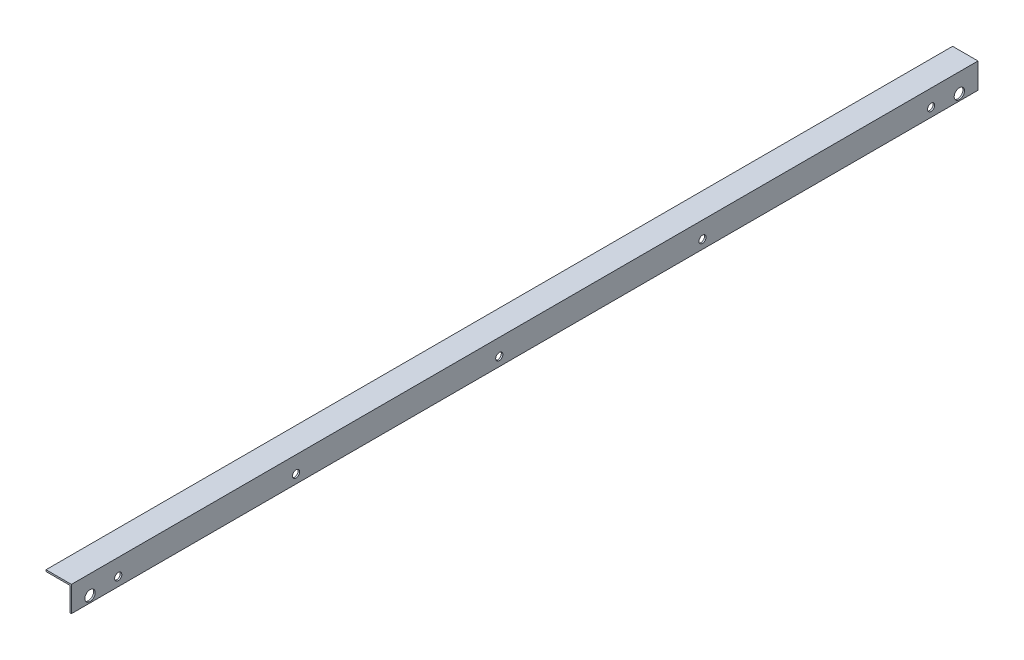
ISO-10303-21;
HEADER;
FILE_DESCRIPTION(('STEP AP214'),'2;1');
FILE_NAME('part.step','',(''),(''),'','','');
FILE_SCHEMA(('AUTOMOTIVE_DESIGN { 1 0 10303 214 1 1 1 1 }'));
ENDSEC;
DATA;
#1=APPLICATION_CONTEXT('core data for automotive mechanical design processes');
#2=APPLICATION_PROTOCOL_DEFINITION('international standard','automotive_design',2000,#1);
#3=PRODUCT_CONTEXT('',#1,'mechanical');
#4=PRODUCT('Part','Part','',(#3));
#5=PRODUCT_RELATED_PRODUCT_CATEGORY('part','',(#4));
#6=PRODUCT_DEFINITION_FORMATION('','',#4);
#7=PRODUCT_DEFINITION_CONTEXT('part definition',#1,'design');
#8=PRODUCT_DEFINITION('design','',#6,#7);
#9=PRODUCT_DEFINITION_SHAPE('','',#8);
#10=(LENGTH_UNIT() NAMED_UNIT(*) SI_UNIT(.MILLI.,.METRE.));
#11=(NAMED_UNIT(*) PLANE_ANGLE_UNIT() SI_UNIT($,.RADIAN.));
#12=(NAMED_UNIT(*) SI_UNIT($,.STERADIAN.) SOLID_ANGLE_UNIT());
#13=UNCERTAINTY_MEASURE_WITH_UNIT(LENGTH_MEASURE(1.E-05),#10,'distance_accuracy_value','');
#14=(GEOMETRIC_REPRESENTATION_CONTEXT(3) GLOBAL_UNCERTAINTY_ASSIGNED_CONTEXT((#13)) GLOBAL_UNIT_ASSIGNED_CONTEXT((#10,
#11,#12)) REPRESENTATION_CONTEXT('',''));
#15=CARTESIAN_POINT('',(0.,0.,0.));
#16=DIRECTION('',(0.,0.,1.));
#17=DIRECTION('',(1.,0.,0.));
#18=AXIS2_PLACEMENT_3D('',#15,#16,#17);
#19=CARTESIAN_POINT('',(26.4682271036927,-4.73976383644786,0.));
#20=DIRECTION('',(-1.,0.,0.));
#21=DIRECTION('',(0.,0.,1.));
#22=AXIS2_PLACEMENT_3D('',#19,#20,#21);
#23=PLANE('',#22);
#24=CARTESIAN_POINT('',(26.4682271036927,7.96023616355214,37.3062499999997));
#25=DIRECTION('',(1.,0.,0.));
#26=DIRECTION('',(0.,1.,0.));
#27=AXIS2_PLACEMENT_3D('',#24,#25,#26);
#28=CIRCLE('',#27,10.31875);
#29=CARTESIAN_POINT('',(26.4682271036927,18.2789861635521,37.3062499999997));
#30=VERTEX_POINT('',#29);
#31=EDGE_CURVE('E85',#30,#30,#28,.T.);
#32=ORIENTED_EDGE('',*,*,#31,.T.);
#33=EDGE_LOOP('',(#32));
#34=FACE_BOUND('',#33,.T.);
#35=CARTESIAN_POINT('',(26.4682271036927,7.96023616355214,1775.61875));
#36=DIRECTION('',(1.,0.,0.));
#37=DIRECTION('',(0.,1.,0.));
#38=AXIS2_PLACEMENT_3D('',#35,#36,#37);
#39=CIRCLE('',#38,10.31875);
#40=CARTESIAN_POINT('',(26.4682271036927,18.2789861635521,1775.61875));
#41=VERTEX_POINT('',#40);
#42=EDGE_CURVE('E122',#41,#41,#39,.T.);
#43=ORIENTED_EDGE('',*,*,#42,.T.);
#44=EDGE_LOOP('',(#43));
#45=FACE_BOUND('',#44,.T.);
#46=CARTESIAN_POINT('',(26.4682271036927,12.7227361635521,1719.2625));
#47=DIRECTION('',(1.,0.,0.));
#48=DIRECTION('',(0.,1.,0.));
#49=AXIS2_PLACEMENT_3D('',#46,#47,#48);
#50=CIRCLE('',#49,7.14375);
#51=CARTESIAN_POINT('',(26.4682271036927,19.8664861635521,1719.2625));
#52=VERTEX_POINT('',#51);
#53=EDGE_CURVE('E125',#52,#52,#50,.T.);
#54=ORIENTED_EDGE('',*,*,#53,.T.);
#55=EDGE_LOOP('',(#54));
#56=FACE_BOUND('',#55,.T.);
#57=CARTESIAN_POINT('',(26.4682271036927,12.7227361635521,1363.6625));
#58=DIRECTION('',(1.,0.,0.));
#59=DIRECTION('',(0.,1.,0.));
#60=AXIS2_PLACEMENT_3D('',#57,#58,#59);
#61=CIRCLE('',#60,7.14375);
#62=CARTESIAN_POINT('',(26.4682271036927,19.8664861635521,1363.6625));
#63=VERTEX_POINT('',#62);
#64=EDGE_CURVE('E128',#63,#63,#61,.T.);
#65=ORIENTED_EDGE('',*,*,#64,.T.);
#66=EDGE_LOOP('',(#65));
#67=FACE_BOUND('',#66,.T.);
#68=CARTESIAN_POINT('',(26.4682271036927,12.7227361635521,957.2625));
#69=DIRECTION('',(1.,0.,0.));
#70=DIRECTION('',(0.,1.,0.));
#71=AXIS2_PLACEMENT_3D('',#68,#69,#70);
#72=CIRCLE('',#71,7.14375);
#73=CARTESIAN_POINT('',(26.4682271036927,19.8664861635521,957.2625));
#74=VERTEX_POINT('',#73);
#75=EDGE_CURVE('E131',#74,#74,#72,.T.);
#76=ORIENTED_EDGE('',*,*,#75,.T.);
#77=EDGE_LOOP('',(#76));
#78=FACE_BOUND('',#77,.T.);
#79=CARTESIAN_POINT('',(26.4682271036927,12.7227361635521,550.8625));
#80=DIRECTION('',(1.,0.,0.));
#81=DIRECTION('',(0.,1.,0.));
#82=AXIS2_PLACEMENT_3D('',#79,#80,#81);
#83=CIRCLE('',#82,7.14375);
#84=CARTESIAN_POINT('',(26.4682271036927,19.8664861635521,550.8625));
#85=VERTEX_POINT('',#84);
#86=EDGE_CURVE('E133',#85,#85,#83,.T.);
#87=ORIENTED_EDGE('',*,*,#86,.T.);
#88=EDGE_LOOP('',(#87));
#89=FACE_BOUND('',#88,.T.);
#90=CARTESIAN_POINT('',(26.4682271036927,12.7227361635521,93.6625));
#91=DIRECTION('',(1.,0.,0.));
#92=DIRECTION('',(0.,1.,0.));
#93=AXIS2_PLACEMENT_3D('',#90,#91,#92);
#94=CIRCLE('',#93,7.14375);
#95=CARTESIAN_POINT('',(26.4682271036927,19.8664861635521,93.6625));
#96=VERTEX_POINT('',#95);
#97=EDGE_CURVE('E20',#96,#96,#94,.T.);
#98=ORIENTED_EDGE('',*,*,#97,.T.);
#99=EDGE_LOOP('',(#98));
#100=FACE_BOUND('',#99,.T.);
#101=DIRECTION('',(0.,1.,0.));
#102=VECTOR('',#101,1.);
#103=CARTESIAN_POINT('',(26.4682271036927,31.8223455385522,1812.925));
#104=LINE('',#103,#102);
#105=CARTESIAN_POINT('',(26.4682271036927,42.8852361635522,1812.925));
#106=VERTEX_POINT('',#105);
#107=CARTESIAN_POINT('',(26.4682271036927,-4.73976383644786,1812.925));
#108=VERTEX_POINT('',#107);
#109=EDGE_CURVE('E73',#106,#108,#104,.F.);
#110=ORIENTED_EDGE('',*,*,#109,.F.);
#111=DIRECTION('',(0.,0.,-1.));
#112=VECTOR('',#111,1.);
#113=CARTESIAN_POINT('',(26.4682271036927,42.8852361635522,0.));
#114=LINE('',#113,#112);
#115=CARTESIAN_POINT('',(26.4682271036927,42.8852361635522,0.));
#116=VERTEX_POINT('',#115);
#117=EDGE_CURVE('E70',#116,#106,#114,.F.);
#118=ORIENTED_EDGE('',*,*,#117,.F.);
#119=DIRECTION('',(0.,1.,0.));
#120=VECTOR('',#119,1.);
#121=CARTESIAN_POINT('',(26.4682271036927,31.8223455385522,0.));
#122=LINE('',#121,#120);
#123=CARTESIAN_POINT('',(26.4682271036927,-4.73976383644786,0.));
#124=VERTEX_POINT('',#123);
#125=EDGE_CURVE('E67',#116,#124,#122,.F.);
#126=ORIENTED_EDGE('',*,*,#125,.T.);
#127=DIRECTION('',(0.,0.,-1.));
#128=VECTOR('',#127,1.);
#129=CARTESIAN_POINT('',(26.4682271036927,-4.73976383644786,0.));
#130=LINE('',#129,#128);
#131=EDGE_CURVE('E77',#108,#124,#130,.T.);
#132=ORIENTED_EDGE('',*,*,#131,.F.);
#133=EDGE_LOOP('',(#110,#118,#126,#132));
#134=FACE_BOUND('',#133,.T.);
#135=ADVANCED_FACE('F17',(#34,#45,#56,#67,#78,#89,#100,#134),#23,.T.);
#136=CARTESIAN_POINT('',(26.4682271036927,42.8852361635522,0.));
#137=DIRECTION('',(0.,-1.,0.));
#138=DIRECTION('',(0.,0.,-1.));
#139=AXIS2_PLACEMENT_3D('',#136,#137,#138);
#140=PLANE('',#139);
#141=DIRECTION('',(1.,0.,0.));
#142=VECTOR('',#141,1.);
#143=CARTESIAN_POINT('',(15.4053364786927,42.8852361635522,1812.925));
#144=LINE('',#143,#142);
#145=CARTESIAN_POINT('',(-21.1567728963072,42.8852361635522,1812.925));
#146=VERTEX_POINT('',#145);
#147=EDGE_CURVE('E319',#146,#106,#144,.T.);
#148=ORIENTED_EDGE('',*,*,#147,.F.);
#149=DIRECTION('',(0.,0.,1.));
#150=VECTOR('',#149,1.);
#151=CARTESIAN_POINT('',(-21.1567728963072,42.8852361635522,0.));
#152=LINE('',#151,#150);
#153=CARTESIAN_POINT('',(-21.1567728963072,42.8852361635522,0.));
#154=VERTEX_POINT('',#153);
#155=EDGE_CURVE('E82',#154,#146,#152,.T.);
#156=ORIENTED_EDGE('',*,*,#155,.F.);
#157=DIRECTION('',(1.,0.,0.));
#158=VECTOR('',#157,1.);
#159=CARTESIAN_POINT('',(15.4053364786927,42.8852361635522,0.));
#160=LINE('',#159,#158);
#161=EDGE_CURVE('E80',#154,#116,#160,.T.);
#162=ORIENTED_EDGE('',*,*,#161,.T.);
#163=ORIENTED_EDGE('',*,*,#117,.T.);
#164=EDGE_LOOP('',(#148,#156,#162,#163));
#165=FACE_BOUND('',#164,.T.);
#166=ADVANCED_FACE('F81',(#165),#140,.T.);
#167=CARTESIAN_POINT('',(29.6432271036926,-4.73976383644786,0.));
#168=DIRECTION('',(0.,-1.,0.));
#169=DIRECTION('',(0.,0.,-1.));
#170=AXIS2_PLACEMENT_3D('',#167,#168,#169);
#171=PLANE('',#170);
#172=DIRECTION('',(1.,0.,0.));
#173=VECTOR('',#172,1.);
#174=CARTESIAN_POINT('',(15.4053364786927,-4.73976383644786,1812.925));
#175=LINE('',#174,#173);
#176=CARTESIAN_POINT('',(29.6432271036926,-4.73976383644786,1812.925));
#177=VERTEX_POINT('',#176);
#178=EDGE_CURVE('E327',#108,#177,#175,.T.);
#179=ORIENTED_EDGE('',*,*,#178,.F.);
#180=ORIENTED_EDGE('',*,*,#131,.T.);
#181=DIRECTION('',(1.,0.,0.));
#182=VECTOR('',#181,1.);
#183=CARTESIAN_POINT('',(15.4053364786927,-4.73976383644786,0.));
#184=LINE('',#183,#182);
#185=CARTESIAN_POINT('',(29.6432271036926,-4.73976383644786,0.));
#186=VERTEX_POINT('',#185);
#187=EDGE_CURVE('E90',#124,#186,#184,.T.);
#188=ORIENTED_EDGE('',*,*,#187,.T.);
#189=DIRECTION('',(0.,0.,-1.));
#190=VECTOR('',#189,1.);
#191=CARTESIAN_POINT('',(29.6432271036926,-4.73976383644785,0.));
#192=LINE('',#191,#190);
#193=EDGE_CURVE('E119',#177,#186,#192,.T.);
#194=ORIENTED_EDGE('',*,*,#193,.F.);
#195=EDGE_LOOP('',(#179,#180,#188,#194));
#196=FACE_BOUND('',#195,.T.);
#197=ADVANCED_FACE('F144',(#196),#171,.T.);
#198=CARTESIAN_POINT('',(26.4682271036927,12.7227361635521,93.6625));
#199=DIRECTION('',(1.,0.,0.));
#200=DIRECTION('',(0.,1.,0.));
#201=AXIS2_PLACEMENT_3D('',#198,#199,#200);
#202=CYLINDRICAL_SURFACE('',#201,7.14375);
#203=CARTESIAN_POINT('',(29.6432271036926,12.7227361635521,93.6625));
#204=DIRECTION('',(1.,0.,0.));
#205=DIRECTION('',(0.,1.,0.));
#206=AXIS2_PLACEMENT_3D('',#203,#204,#205);
#207=CIRCLE('',#206,7.14375);
#208=CARTESIAN_POINT('',(29.6432271036926,19.8664861635521,93.6625));
#209=VERTEX_POINT('',#208);
#210=EDGE_CURVE('E116',#209,#209,#207,.F.);
#211=ORIENTED_EDGE('',*,*,#210,.F.);
#212=EDGE_LOOP('',(#211));
#213=FACE_BOUND('',#212,.T.);
#214=ORIENTED_EDGE('',*,*,#97,.F.);
#215=EDGE_LOOP('',(#214));
#216=FACE_BOUND('',#215,.T.);
#217=ADVANCED_FACE('F141',(#213,#216),#202,.F.);
#218=CARTESIAN_POINT('',(26.4682271036927,12.7227361635521,550.8625));
#219=DIRECTION('',(1.,0.,0.));
#220=DIRECTION('',(0.,1.,0.));
#221=AXIS2_PLACEMENT_3D('',#218,#219,#220);
#222=CYLINDRICAL_SURFACE('',#221,7.14375);
#223=CARTESIAN_POINT('',(29.6432271036926,12.7227361635521,550.8625));
#224=DIRECTION('',(1.,0.,0.));
#225=DIRECTION('',(0.,1.,0.));
#226=AXIS2_PLACEMENT_3D('',#223,#224,#225);
#227=CIRCLE('',#226,7.14375);
#228=CARTESIAN_POINT('',(29.6432271036926,19.8664861635521,550.8625));
#229=VERTEX_POINT('',#228);
#230=EDGE_CURVE('E113',#229,#229,#227,.F.);
#231=ORIENTED_EDGE('',*,*,#230,.F.);
#232=EDGE_LOOP('',(#231));
#233=FACE_BOUND('',#232,.T.);
#234=ORIENTED_EDGE('',*,*,#86,.F.);
#235=EDGE_LOOP('',(#234));
#236=FACE_BOUND('',#235,.T.);
#237=ADVANCED_FACE('F143',(#233,#236),#222,.F.);
#238=CARTESIAN_POINT('',(26.4682271036927,12.7227361635521,957.2625));
#239=DIRECTION('',(1.,0.,0.));
#240=DIRECTION('',(0.,1.,0.));
#241=AXIS2_PLACEMENT_3D('',#238,#239,#240);
#242=CYLINDRICAL_SURFACE('',#241,7.14375);
#243=CARTESIAN_POINT('',(29.6432271036926,12.7227361635521,957.2625));
#244=DIRECTION('',(1.,0.,0.));
#245=DIRECTION('',(0.,1.,0.));
#246=AXIS2_PLACEMENT_3D('',#243,#244,#245);
#247=CIRCLE('',#246,7.14375);
#248=CARTESIAN_POINT('',(29.6432271036926,19.8664861635521,957.2625));
#249=VERTEX_POINT('',#248);
#250=EDGE_CURVE('E110',#249,#249,#247,.F.);
#251=ORIENTED_EDGE('',*,*,#250,.F.);
#252=EDGE_LOOP('',(#251));
#253=FACE_BOUND('',#252,.T.);
#254=ORIENTED_EDGE('',*,*,#75,.F.);
#255=EDGE_LOOP('',(#254));
#256=FACE_BOUND('',#255,.T.);
#257=ADVANCED_FACE('F152',(#253,#256),#242,.F.);
#258=CARTESIAN_POINT('',(26.4682271036927,12.7227361635521,1363.6625));
#259=DIRECTION('',(1.,0.,0.));
#260=DIRECTION('',(0.,1.,0.));
#261=AXIS2_PLACEMENT_3D('',#258,#259,#260);
#262=CYLINDRICAL_SURFACE('',#261,7.14375);
#263=CARTESIAN_POINT('',(29.6432271036926,12.7227361635521,1363.6625));
#264=DIRECTION('',(1.,0.,0.));
#265=DIRECTION('',(0.,1.,0.));
#266=AXIS2_PLACEMENT_3D('',#263,#264,#265);
#267=CIRCLE('',#266,7.14375);
#268=CARTESIAN_POINT('',(29.6432271036926,19.8664861635521,1363.6625));
#269=VERTEX_POINT('',#268);
#270=EDGE_CURVE('E107',#269,#269,#267,.F.);
#271=ORIENTED_EDGE('',*,*,#270,.F.);
#272=EDGE_LOOP('',(#271));
#273=FACE_BOUND('',#272,.T.);
#274=ORIENTED_EDGE('',*,*,#64,.F.);
#275=EDGE_LOOP('',(#274));
#276=FACE_BOUND('',#275,.T.);
#277=ADVANCED_FACE('F190',(#273,#276),#262,.F.);
#278=CARTESIAN_POINT('',(26.4682271036927,12.7227361635521,1719.2625));
#279=DIRECTION('',(1.,0.,0.));
#280=DIRECTION('',(0.,1.,0.));
#281=AXIS2_PLACEMENT_3D('',#278,#279,#280);
#282=CYLINDRICAL_SURFACE('',#281,7.14375);
#283=CARTESIAN_POINT('',(29.6432271036926,12.7227361635521,1719.2625));
#284=DIRECTION('',(1.,0.,0.));
#285=DIRECTION('',(0.,1.,0.));
#286=AXIS2_PLACEMENT_3D('',#283,#284,#285);
#287=CIRCLE('',#286,7.14375);
#288=CARTESIAN_POINT('',(29.6432271036926,19.8664861635521,1719.2625));
#289=VERTEX_POINT('',#288);
#290=EDGE_CURVE('E104',#289,#289,#287,.F.);
#291=ORIENTED_EDGE('',*,*,#290,.F.);
#292=EDGE_LOOP('',(#291));
#293=FACE_BOUND('',#292,.T.);
#294=ORIENTED_EDGE('',*,*,#53,.F.);
#295=EDGE_LOOP('',(#294));
#296=FACE_BOUND('',#295,.T.);
#297=ADVANCED_FACE('F186',(#293,#296),#282,.F.);
#298=CARTESIAN_POINT('',(26.4682271036927,7.96023616355214,1775.61875));
#299=DIRECTION('',(1.,0.,0.));
#300=DIRECTION('',(0.,1.,0.));
#301=AXIS2_PLACEMENT_3D('',#298,#299,#300);
#302=CYLINDRICAL_SURFACE('',#301,10.31875);
#303=CARTESIAN_POINT('',(29.6432271036926,7.96023616355214,1775.61875));
#304=DIRECTION('',(1.,0.,0.));
#305=DIRECTION('',(0.,1.,0.));
#306=AXIS2_PLACEMENT_3D('',#303,#304,#305);
#307=CIRCLE('',#306,10.31875);
#308=CARTESIAN_POINT('',(29.6432271036926,18.2789861635521,1775.61875));
#309=VERTEX_POINT('',#308);
#310=EDGE_CURVE('E101',#309,#309,#307,.F.);
#311=ORIENTED_EDGE('',*,*,#310,.F.);
#312=EDGE_LOOP('',(#311));
#313=FACE_BOUND('',#312,.T.);
#314=ORIENTED_EDGE('',*,*,#42,.F.);
#315=EDGE_LOOP('',(#314));
#316=FACE_BOUND('',#315,.T.);
#317=ADVANCED_FACE('F182',(#313,#316),#302,.F.);
#318=CARTESIAN_POINT('',(26.4682271036927,7.96023616355214,37.3062499999997));
#319=DIRECTION('',(1.,0.,0.));
#320=DIRECTION('',(0.,1.,0.));
#321=AXIS2_PLACEMENT_3D('',#318,#319,#320);
#322=CYLINDRICAL_SURFACE('',#321,10.31875);
#323=CARTESIAN_POINT('',(29.6432271036926,7.96023616355214,37.3062499999997));
#324=DIRECTION('',(1.,0.,0.));
#325=DIRECTION('',(0.,1.,0.));
#326=AXIS2_PLACEMENT_3D('',#323,#324,#325);
#327=CIRCLE('',#326,10.31875);
#328=CARTESIAN_POINT('',(29.6432271036926,18.2789861635521,37.3062499999997));
#329=VERTEX_POINT('',#328);
#330=EDGE_CURVE('E97',#329,#329,#327,.F.);
#331=ORIENTED_EDGE('',*,*,#330,.F.);
#332=EDGE_LOOP('',(#331));
#333=FACE_BOUND('',#332,.T.);
#334=ORIENTED_EDGE('',*,*,#31,.F.);
#335=EDGE_LOOP('',(#334));
#336=FACE_BOUND('',#335,.T.);
#337=ADVANCED_FACE('F179',(#333,#336),#322,.F.);
#338=CARTESIAN_POINT('',(15.4053364786927,31.8223455385522,0.));
#339=DIRECTION('',(0.,0.,1.));
#340=DIRECTION('',(1.,0.,0.));
#341=AXIS2_PLACEMENT_3D('',#338,#339,#340);
#342=PLANE('',#341);
#343=ORIENTED_EDGE('',*,*,#187,.F.);
#344=ORIENTED_EDGE('',*,*,#125,.F.);
#345=ORIENTED_EDGE('',*,*,#161,.F.);
#346=DIRECTION('',(0.,1.,0.));
#347=VECTOR('',#346,1.);
#348=CARTESIAN_POINT('',(-21.1567728963072,42.8852361635522,0.));
#349=LINE('',#348,#347);
#350=CARTESIAN_POINT('',(-21.1567728963072,46.0602361635522,0.));
#351=VERTEX_POINT('',#350);
#352=EDGE_CURVE('E92',#351,#154,#349,.F.);
#353=ORIENTED_EDGE('',*,*,#352,.F.);
#354=DIRECTION('',(1.,0.,0.));
#355=VECTOR('',#354,1.);
#356=CARTESIAN_POINT('',(-21.1567728963072,46.0602361635522,0.));
#357=LINE('',#356,#355);
#358=CARTESIAN_POINT('',(29.6432271036926,46.0602361635522,0.));
#359=VERTEX_POINT('',#358);
#360=EDGE_CURVE('E100',#359,#351,#357,.F.);
#361=ORIENTED_EDGE('',*,*,#360,.F.);
#362=DIRECTION('',(0.,1.,0.));
#363=VECTOR('',#362,1.);
#364=CARTESIAN_POINT('',(29.6432271036926,46.0602361635522,0.));
#365=LINE('',#364,#363);
#366=EDGE_CURVE('E316',#186,#359,#365,.T.);
#367=ORIENTED_EDGE('',*,*,#366,.F.);
#368=EDGE_LOOP('',(#343,#344,#345,#353,#361,#367));
#369=FACE_BOUND('',#368,.T.);
#370=ADVANCED_FACE('F88',(#369),#342,.F.);
#371=CARTESIAN_POINT('',(-21.1567728963072,42.8852361635522,0.));
#372=DIRECTION('',(-1.,0.,0.));
#373=DIRECTION('',(0.,0.,1.));
#374=AXIS2_PLACEMENT_3D('',#371,#372,#373);
#375=PLANE('',#374);
#376=DIRECTION('',(0.,1.,0.));
#377=VECTOR('',#376,1.);
#378=CARTESIAN_POINT('',(-21.1567728963072,31.8223455385522,1812.925));
#379=LINE('',#378,#377);
#380=CARTESIAN_POINT('',(-21.1567728963072,46.0602361635522,1812.925));
#381=VERTEX_POINT('',#380);
#382=EDGE_CURVE('E324',#381,#146,#379,.F.);
#383=ORIENTED_EDGE('',*,*,#382,.F.);
#384=DIRECTION('',(0.,0.,1.));
#385=VECTOR('',#384,1.);
#386=CARTESIAN_POINT('',(-21.1567728963072,46.0602361635522,0.));
#387=LINE('',#386,#385);
#388=EDGE_CURVE('E332',#351,#381,#387,.T.);
#389=ORIENTED_EDGE('',*,*,#388,.F.);
#390=ORIENTED_EDGE('',*,*,#352,.T.);
#391=ORIENTED_EDGE('',*,*,#155,.T.);
#392=EDGE_LOOP('',(#383,#389,#390,#391));
#393=FACE_BOUND('',#392,.T.);
#394=ADVANCED_FACE('F173',(#393),#375,.T.);
#395=CARTESIAN_POINT('',(15.4053364786927,31.8223455385522,1812.925));
#396=DIRECTION('',(0.,0.,1.));
#397=DIRECTION('',(1.,0.,0.));
#398=AXIS2_PLACEMENT_3D('',#395,#396,#397);
#399=PLANE('',#398);
#400=ORIENTED_EDGE('',*,*,#382,.T.);
#401=ORIENTED_EDGE('',*,*,#147,.T.);
#402=ORIENTED_EDGE('',*,*,#109,.T.);
#403=ORIENTED_EDGE('',*,*,#178,.T.);
#404=DIRECTION('',(0.,1.,0.));
#405=VECTOR('',#404,1.);
#406=CARTESIAN_POINT('',(29.6432271036926,46.0602361635522,1812.925));
#407=LINE('',#406,#405);
#408=CARTESIAN_POINT('',(29.6432271036926,46.0602361635522,1812.925));
#409=VERTEX_POINT('',#408);
#410=EDGE_CURVE('E35',#409,#177,#407,.F.);
#411=ORIENTED_EDGE('',*,*,#410,.F.);
#412=DIRECTION('',(1.,0.,0.));
#413=VECTOR('',#412,1.);
#414=CARTESIAN_POINT('',(-21.1567728963072,46.0602361635522,1812.925));
#415=LINE('',#414,#413);
#416=EDGE_CURVE('E26',#381,#409,#415,.T.);
#417=ORIENTED_EDGE('',*,*,#416,.F.);
#418=EDGE_LOOP('',(#400,#401,#402,#403,#411,#417));
#419=FACE_BOUND('',#418,.T.);
#420=ADVANCED_FACE('F166',(#419),#399,.T.);
#421=CARTESIAN_POINT('',(29.6432271036926,46.0602361635522,0.));
#422=DIRECTION('',(1.,0.,0.));
#423=DIRECTION('',(0.,0.,-1.));
#424=AXIS2_PLACEMENT_3D('',#421,#422,#423);
#425=PLANE('',#424);
#426=ORIENTED_EDGE('',*,*,#330,.T.);
#427=EDGE_LOOP('',(#426));
#428=FACE_BOUND('',#427,.T.);
#429=ORIENTED_EDGE('',*,*,#310,.T.);
#430=EDGE_LOOP('',(#429));
#431=FACE_BOUND('',#430,.T.);
#432=ORIENTED_EDGE('',*,*,#290,.T.);
#433=EDGE_LOOP('',(#432));
#434=FACE_BOUND('',#433,.T.);
#435=ORIENTED_EDGE('',*,*,#270,.T.);
#436=EDGE_LOOP('',(#435));
#437=FACE_BOUND('',#436,.T.);
#438=ORIENTED_EDGE('',*,*,#250,.T.);
#439=EDGE_LOOP('',(#438));
#440=FACE_BOUND('',#439,.T.);
#441=ORIENTED_EDGE('',*,*,#230,.T.);
#442=EDGE_LOOP('',(#441));
#443=FACE_BOUND('',#442,.T.);
#444=ORIENTED_EDGE('',*,*,#210,.T.);
#445=EDGE_LOOP('',(#444));
#446=FACE_BOUND('',#445,.T.);
#447=ORIENTED_EDGE('',*,*,#410,.T.);
#448=ORIENTED_EDGE('',*,*,#193,.T.);
#449=ORIENTED_EDGE('',*,*,#366,.T.);
#450=DIRECTION('',(0.,0.,1.));
#451=VECTOR('',#450,1.);
#452=CARTESIAN_POINT('',(29.6432271036927,46.0602361635522,0.));
#453=LINE('',#452,#451);
#454=EDGE_CURVE('E11',#409,#359,#453,.F.);
#455=ORIENTED_EDGE('',*,*,#454,.F.);
#456=EDGE_LOOP('',(#447,#448,#449,#455));
#457=FACE_BOUND('',#456,.T.);
#458=ADVANCED_FACE('F160',(#428,#431,#434,#437,#440,#443,#446,#457),#425,.T.);
#459=CARTESIAN_POINT('',(-21.1567728963072,46.0602361635522,0.));
#460=DIRECTION('',(0.,1.,0.));
#461=DIRECTION('',(0.,0.,1.));
#462=AXIS2_PLACEMENT_3D('',#459,#460,#461);
#463=PLANE('',#462);
#464=ORIENTED_EDGE('',*,*,#416,.T.);
#465=ORIENTED_EDGE('',*,*,#454,.T.);
#466=ORIENTED_EDGE('',*,*,#360,.T.);
#467=ORIENTED_EDGE('',*,*,#388,.T.);
#468=EDGE_LOOP('',(#464,#465,#466,#467));
#469=FACE_BOUND('',#468,.T.);
#470=ADVANCED_FACE('F158',(#469),#463,.T.);
#471=CLOSED_SHELL('',(#135,#166,#197,#217,#237,#257,#277,#297,#317,#337,#370,#394,#420,#458,#470));
#472=MANIFOLD_SOLID_BREP('B1',#471);
#473=ADVANCED_BREP_SHAPE_REPRESENTATION('',(#18,#472),#14);
#474=SHAPE_DEFINITION_REPRESENTATION(#9,#473);
ENDSEC;
END-ISO-10303-21;
